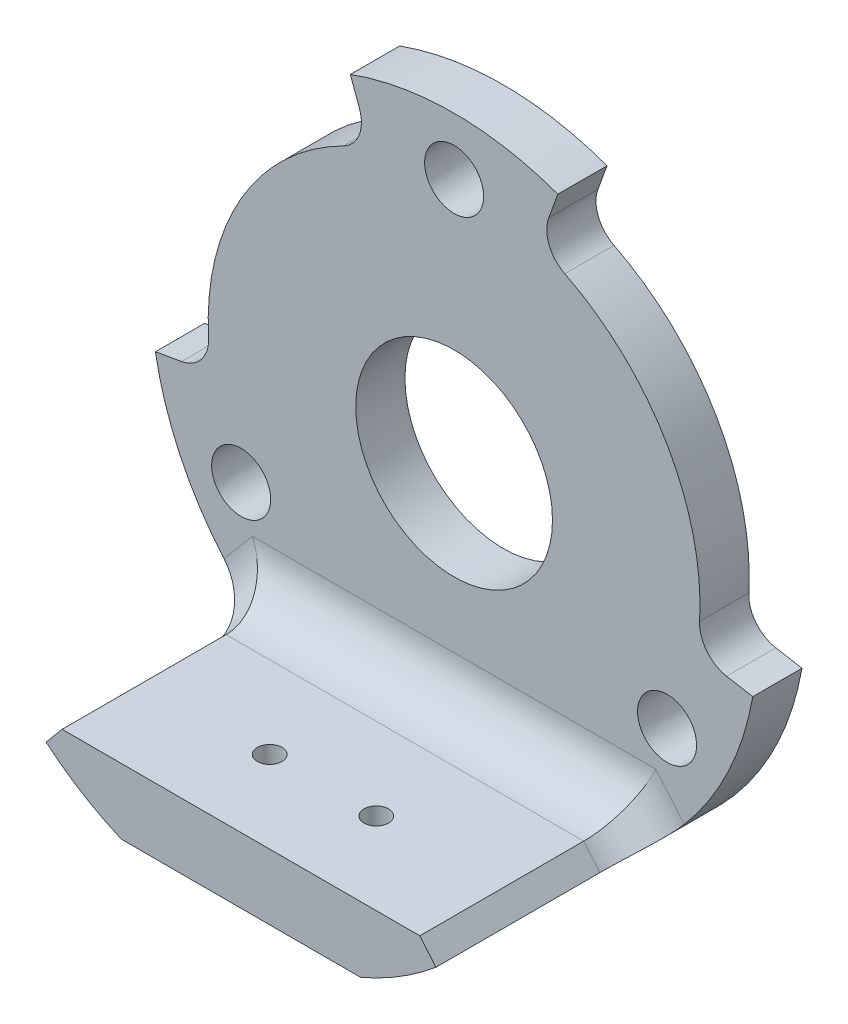
ISO-10303-21;
HEADER;
FILE_DESCRIPTION(('STEP AP214'),'2;1');
FILE_NAME('part.step','',(''),(''),'','','');
FILE_SCHEMA(('AUTOMOTIVE_DESIGN { 1 0 10303 214 1 1 1 1 }'));
ENDSEC;
DATA;
#1=APPLICATION_CONTEXT('core data for automotive mechanical design processes');
#2=APPLICATION_PROTOCOL_DEFINITION('international standard','automotive_design',2000,#1);
#3=PRODUCT_CONTEXT('',#1,'mechanical');
#4=PRODUCT('Part','Part','',(#3));
#5=PRODUCT_RELATED_PRODUCT_CATEGORY('part','',(#4));
#6=PRODUCT_DEFINITION_FORMATION('','',#4);
#7=PRODUCT_DEFINITION_CONTEXT('part definition',#1,'design');
#8=PRODUCT_DEFINITION('design','',#6,#7);
#9=PRODUCT_DEFINITION_SHAPE('','',#8);
#10=(LENGTH_UNIT() NAMED_UNIT(*) SI_UNIT(.MILLI.,.METRE.));
#11=(NAMED_UNIT(*) PLANE_ANGLE_UNIT() SI_UNIT($,.RADIAN.));
#12=(NAMED_UNIT(*) SI_UNIT($,.STERADIAN.) SOLID_ANGLE_UNIT());
#13=UNCERTAINTY_MEASURE_WITH_UNIT(LENGTH_MEASURE(1.E-05),#10,'distance_accuracy_value','');
#14=(GEOMETRIC_REPRESENTATION_CONTEXT(3) GLOBAL_UNCERTAINTY_ASSIGNED_CONTEXT((#13)) GLOBAL_UNIT_ASSIGNED_CONTEXT((#10,
#11,#12)) REPRESENTATION_CONTEXT('',''));
#15=CARTESIAN_POINT('',(0.,0.,0.));
#16=DIRECTION('',(0.,0.,1.));
#17=DIRECTION('',(1.,0.,0.));
#18=AXIS2_PLACEMENT_3D('',#15,#16,#17);
#19=CARTESIAN_POINT('',(-450.,300.,16.));
#20=DIRECTION('',(0.,0.,-1.));
#21=DIRECTION('',(-1.,0.,0.));
#22=AXIS2_PLACEMENT_3D('',#19,#20,#21);
#23=CYLINDRICAL_SURFACE('',#22,18.4999999999999);
#24=DIRECTION('',(0.,0.,-1.));
#25=VECTOR('',#24,1.);
#26=CARTESIAN_POINT('',(-468.218943430726,296.787508713162,16.));
#27=LINE('',#26,#25);
#28=CARTESIAN_POINT('',(-468.218943430726,296.787508713162,3.));
#29=VERTEX_POINT('',#28);
#30=CARTESIAN_POINT('',(-468.218943430726,296.787508713162,0.));
#31=VERTEX_POINT('',#30);
#32=EDGE_CURVE('E184',#29,#31,#27,.T.);
#33=ORIENTED_EDGE('',*,*,#32,.T.);
#34=CARTESIAN_POINT('',(-450.,300.,0.));
#35=DIRECTION('',(0.,0.,-1.));
#36=DIRECTION('',(-1.,0.,0.));
#37=AXIS2_PLACEMENT_3D('',#34,#35,#36);
#38=CIRCLE('',#37,18.4999999999999);
#39=CARTESIAN_POINT('',(-457.297259759663,283.,0.));
#40=VERTEX_POINT('',#39);
#41=EDGE_CURVE('E201',#40,#31,#38,.T.);
#42=ORIENTED_EDGE('',*,*,#41,.F.);
#43=DIRECTION('',(0.,0.,-1.));
#44=VECTOR('',#43,1.);
#45=CARTESIAN_POINT('',(-457.297259759663,283.,16.));
#46=LINE('',#45,#44);
#47=CARTESIAN_POINT('',(-457.297259759663,283.,16.));
#48=VERTEX_POINT('',#47);
#49=EDGE_CURVE('E214',#48,#40,#46,.T.);
#50=ORIENTED_EDGE('',*,*,#49,.F.);
#51=CARTESIAN_POINT('',(-450.,300.,16.));
#52=DIRECTION('',(0.,0.,-1.));
#53=DIRECTION('',(-1.,0.,0.));
#54=AXIS2_PLACEMENT_3D('',#51,#52,#53);
#55=CIRCLE('',#54,18.4999999999999);
#56=CARTESIAN_POINT('',(-461.891570779201,285.828177802299,16.));
#57=VERTEX_POINT('',#56);
#58=EDGE_CURVE('E363',#48,#57,#55,.T.);
#59=ORIENTED_EDGE('',*,*,#58,.T.);
#60=DIRECTION('',(0.,0.,1.));
#61=VECTOR('',#60,1.);
#62=CARTESIAN_POINT('',(-461.891570779201,285.828177802299,3.));
#63=LINE('',#62,#61);
#64=CARTESIAN_POINT('',(-461.891570779201,285.828177802299,6.));
#65=VERTEX_POINT('',#64);
#66=EDGE_CURVE('E372',#65,#57,#63,.T.);
#67=ORIENTED_EDGE('',*,*,#66,.F.);
#68=CARTESIAN_POINT('',(-461.891570779201,285.828177802299,6.));
#69=CARTESIAN_POINT('',(-461.891561832716,285.828175903261,5.91564209092245));
#70=CARTESIAN_POINT('',(-461.894296370243,285.830464991089,5.8312880154373));
#71=CARTESIAN_POINT('',(-461.905184455433,285.839608915823,5.66318300067403));
#72=CARTESIAN_POINT('',(-461.913337749161,285.846463538778,5.57943203331897));
#73=CARTESIAN_POINT('',(-461.934987712819,285.864715830558,5.4131797233746));
#74=CARTESIAN_POINT('',(-461.948480585121,285.8761102706,5.33067753582939));
#75=CARTESIAN_POINT('',(-461.980660538156,285.903397084787,5.16747396488535));
#76=CARTESIAN_POINT('',(-461.99934755538,285.919289403934,5.08677255948084));
#77=CARTESIAN_POINT('',(-462.062974690479,285.973674498502,4.84814574209821));
#78=CARTESIAN_POINT('',(-462.115489503887,286.018882523045,4.69363250397793));
#79=CARTESIAN_POINT('',(-462.238582123251,286.126509326838,4.39855187902926));
#80=CARTESIAN_POINT('',(-462.309156819291,286.188925143047,4.25798209691254));
#81=CARTESIAN_POINT('',(-462.465581310532,286.329947684353,3.99480370285346));
#82=CARTESIAN_POINT('',(-462.551414094702,286.408536393742,3.87217536298743));
#83=CARTESIAN_POINT('',(-462.735167099182,286.580561890107,3.64821456642375));
#84=CARTESIAN_POINT('',(-462.833088352432,286.673999946131,3.54688393158154));
#85=CARTESIAN_POINT('',(-463.036930499919,286.873360768654,3.36878772342432));
#86=CARTESIAN_POINT('',(-463.142814088538,286.979226475978,3.29191546093324));
#87=CARTESIAN_POINT('',(-463.359229889972,287.201368707071,3.16420670205903));
#88=CARTESIAN_POINT('',(-463.469760203595,287.31764099902,3.11335967856258));
#89=CARTESIAN_POINT('',(-463.656309640338,287.519310136634,3.050756367322));
#90=CARTESIAN_POINT('',(-463.732099900945,287.602735984173,3.03170618353173));
#91=CARTESIAN_POINT('',(-463.88296187137,287.77190385761,3.00632821535811));
#92=CARTESIAN_POINT('',(-463.958034501051,287.857642155565,2.9999810649817));
#93=CARTESIAN_POINT('',(-464.032308732693,287.944117136004,3.));
#94=B_SPLINE_CURVE_WITH_KNOTS('',3,(#68,#69,#70,#71,#72,#73,#74,#75,#76,#77,#78,#79,#80,#81,#82,
#83,#84,#85,#86,#87,#88,#89,#90,#91,#92,#93),.UNSPECIFIED.,.F.,.F.,(4,2,2,2,2,2,2,2,2,2,2,2,4),
(0.,0.252991459089391,0.505971063339032,0.758771065233071,1.01156797620218,1.51696577565738,
2.02227660401802,2.52702756173576,3.03182167947232,3.53438266130612,4.03674019810098,
4.37898172370028,4.72070109755064),.UNSPECIFIED.);
#95=CARTESIAN_POINT('',(-464.032308732691,287.944117136006,3.));
#96=VERTEX_POINT('',#95);
#97=EDGE_CURVE('E11',#65,#96,#94,.T.);
#98=ORIENTED_EDGE('',*,*,#97,.T.);
#99=CARTESIAN_POINT('',(-450.,300.,3.));
#100=DIRECTION('',(0.,0.,1.));
#101=DIRECTION('',(1.,0.,0.));
#102=AXIS2_PLACEMENT_3D('',#99,#100,#101);
#103=CIRCLE('',#102,18.4999999999974);
#104=EDGE_CURVE('E349',#29,#96,#103,.T.);
#105=ORIENTED_EDGE('',*,*,#104,.F.);
#106=EDGE_LOOP('',(#33,#42,#50,#59,#67,#98,#105));
#107=FACE_BOUND('',#106,.T.);
#108=ADVANCED_FACE('F33',(#107),#23,.T.);
#109=DIRECTION('',(0.,0.,-1.));
#110=VECTOR('',#109,1.);
#111=CARTESIAN_POINT('',(-456.327372651525,317.38431348454,16.));
#112=LINE('',#111,#110);
#113=CARTESIAN_POINT('',(-456.327372651525,317.38431348454,3.));
#114=VERTEX_POINT('',#113);
#115=CARTESIAN_POINT('',(-456.327372651525,317.38431348454,0.));
#116=VERTEX_POINT('',#115);
#117=EDGE_CURVE('E173',#114,#116,#112,.T.);
#118=ORIENTED_EDGE('',*,*,#117,.F.);
#119=CARTESIAN_POINT('',(-443.672627348475,317.384313484539,3.));
#120=VERTEX_POINT('',#119);
#121=EDGE_CURVE('E388',#120,#114,#103,.T.);
#122=ORIENTED_EDGE('',*,*,#121,.F.);
#123=DIRECTION('',(0.,0.,-1.));
#124=VECTOR('',#123,1.);
#125=CARTESIAN_POINT('',(-443.672627348475,317.384313484539,16.));
#126=LINE('',#125,#124);
#127=CARTESIAN_POINT('',(-443.672627348475,317.384313484539,0.));
#128=VERTEX_POINT('',#127);
#129=EDGE_CURVE('E200',#120,#128,#126,.T.);
#130=ORIENTED_EDGE('',*,*,#129,.T.);
#131=EDGE_CURVE('E192',#116,#128,#38,.T.);
#132=ORIENTED_EDGE('',*,*,#131,.F.);
#133=EDGE_LOOP('',(#118,#122,#130,#132));
#134=FACE_BOUND('',#133,.T.);
#135=ADVANCED_FACE('F199',(#134),#23,.T.);
#136=DIRECTION('',(0.,0.,-1.));
#137=VECTOR('',#136,1.);
#138=CARTESIAN_POINT('',(-431.781056569274,296.787508713161,16.));
#139=LINE('',#138,#137);
#140=CARTESIAN_POINT('',(-431.781056569274,296.787508713161,3.));
#141=VERTEX_POINT('',#140);
#142=CARTESIAN_POINT('',(-431.781056569274,296.787508713161,0.));
#143=VERTEX_POINT('',#142);
#144=EDGE_CURVE('E389',#141,#143,#139,.T.);
#145=ORIENTED_EDGE('',*,*,#144,.F.);
#146=CARTESIAN_POINT('',(-435.967691267309,287.944117136006,3.));
#147=VERTEX_POINT('',#146);
#148=EDGE_CURVE('E375',#147,#141,#103,.T.);
#149=ORIENTED_EDGE('',*,*,#148,.F.);
#150=CARTESIAN_POINT('',(-435.967691267309,287.944117136006,3.));
#151=CARTESIAN_POINT('',(-436.022605743689,287.880191690059,2.99999169666253));
#152=CARTESIAN_POINT('',(-436.077965087806,287.8166486427,3.00345764900537));
#153=CARTESIAN_POINT('',(-436.18916216855,287.690744934522,3.01732267149366));
#154=CARTESIAN_POINT('',(-436.244999922636,287.628384317121,3.02772199572152));
#155=CARTESIAN_POINT('',(-436.356706877025,287.505302532349,3.05543054888459));
#156=CARTESIAN_POINT('',(-436.412576041819,287.444580459957,3.07273587640424));
#157=CARTESIAN_POINT('',(-436.523909730982,287.325156012423,3.11415296284034));
#158=CARTESIAN_POINT('',(-436.579374271127,287.26645355821,3.13826445494451));
#159=CARTESIAN_POINT('',(-436.744584221255,287.093830362407,3.2206873432757));
#160=CARTESIAN_POINT('',(-436.853143520378,286.983396466812,3.28908654735076));
#161=CARTESIAN_POINT('',(-437.062986585019,286.774809934657,3.45086215034474));
#162=CARTESIAN_POINT('',(-437.164272601668,286.676653491105,3.54423077842327));
#163=CARTESIAN_POINT('',(-437.355320342544,286.49521096258,3.75264336084271));
#164=CARTESIAN_POINT('',(-437.445156115387,286.411827808455,3.86753477551894));
#165=CARTESIAN_POINT('',(-437.610779189328,286.260646937639,4.11619778790703));
#166=CARTESIAN_POINT('',(-437.686563018785,286.19285307141,4.24997403692099));
#167=CARTESIAN_POINT('',(-437.82139822441,286.073772849906,4.53303567438746));
#168=CARTESIAN_POINT('',(-437.880397399014,286.022537928427,4.68236751641708));
#169=CARTESIAN_POINT('',(-437.979049941357,285.9376026343,4.99196595185073));
#170=CARTESIAN_POINT('',(-438.018713392267,285.90389312191,5.15222679620042));
#171=CARTESIAN_POINT('',(-438.067997258799,285.862178146174,5.42775591691575));
#172=CARTESIAN_POINT('',(-438.083138440994,285.849427079123,5.54137332577848));
#173=CARTESIAN_POINT('',(-438.103359449919,285.832431780661,5.76997852402208));
#174=CARTESIAN_POINT('',(-438.108452397653,285.828176455406,5.8849643287814));
#175=CARTESIAN_POINT('',(-438.108429220799,285.828177802299,5.99999999999999));
#176=B_SPLINE_CURVE_WITH_KNOTS('',3,(#150,#151,#152,#153,#154,#155,#156,#157,#158,#159,#160,
#161,#162,#163,#164,#165,#166,#167,#168,#169,#170,#171,#172,#173,#174,#175),.UNSPECIFIED.,.F.,
.F.,(4,2,2,2,2,2,2,2,2,2,2,2,4),(0.,0.252746363601873,0.505501989931476,0.758115028444334,
1.01071816550672,1.51593532198415,2.02099543029234,2.52260286111636,3.02433405323906,
3.52760902232846,4.03062126266192,4.37589166843464,4.72071092022148),.UNSPECIFIED.);
#177=CARTESIAN_POINT('',(-438.108429220802,285.828177802303,6.));
#178=VERTEX_POINT('',#177);
#179=EDGE_CURVE('E43',#147,#178,#176,.T.);
#180=ORIENTED_EDGE('',*,*,#179,.T.);
#181=DIRECTION('',(0.,0.,1.));
#182=VECTOR('',#181,1.);
#183=CARTESIAN_POINT('',(-438.108429220802,285.828177802303,3.));
#184=LINE('',#183,#182);
#185=CARTESIAN_POINT('',(-438.108429220802,285.828177802303,16.));
#186=VERTEX_POINT('',#185);
#187=EDGE_CURVE('E206',#178,#186,#184,.T.);
#188=ORIENTED_EDGE('',*,*,#187,.T.);
#189=CARTESIAN_POINT('',(-442.702740240337,283.,16.));
#190=VERTEX_POINT('',#189);
#191=EDGE_CURVE('E213',#186,#190,#55,.T.);
#192=ORIENTED_EDGE('',*,*,#191,.T.);
#193=DIRECTION('',(0.,0.,-1.));
#194=VECTOR('',#193,1.);
#195=CARTESIAN_POINT('',(-442.702740240337,283.,16.));
#196=LINE('',#195,#194);
#197=CARTESIAN_POINT('',(-442.702740240337,283.,0.));
#198=VERTEX_POINT('',#197);
#199=EDGE_CURVE('E217',#190,#198,#196,.T.);
#200=ORIENTED_EDGE('',*,*,#199,.T.);
#201=EDGE_CURVE('E202',#143,#198,#38,.T.);
#202=ORIENTED_EDGE('',*,*,#201,.F.);
#203=EDGE_LOOP('',(#145,#149,#180,#188,#192,#200,#202));
#204=FACE_BOUND('',#203,.T.);
#205=ADVANCED_FACE('F310',(#204),#23,.T.);
#206=CARTESIAN_POINT('',(-442.702740240337,283.,16.));
#207=DIRECTION('',(0.,-1.,0.));
#208=DIRECTION('',(0.,0.,-1.));
#209=AXIS2_PLACEMENT_3D('',#206,#207,#208);
#210=PLANE('',#209);
#211=CARTESIAN_POINT('',(-446.75,283.,11.));
#212=DIRECTION('',(0.,-1.,0.));
#213=DIRECTION('',(0.,0.,-1.));
#214=AXIS2_PLACEMENT_3D('',#211,#212,#213);
#215=CIRCLE('',#214,0.749999999999973);
#216=CARTESIAN_POINT('',(-446.75,283.,10.25));
#217=VERTEX_POINT('',#216);
#218=EDGE_CURVE('E240',#217,#217,#215,.T.);
#219=ORIENTED_EDGE('',*,*,#218,.F.);
#220=EDGE_LOOP('',(#219));
#221=FACE_BOUND('',#220,.T.);
#222=CARTESIAN_POINT('',(-453.25,283.,11.));
#223=DIRECTION('',(0.,-1.,0.));
#224=DIRECTION('',(0.,0.,-1.));
#225=AXIS2_PLACEMENT_3D('',#222,#223,#224);
#226=CIRCLE('',#225,0.749999999999973);
#227=CARTESIAN_POINT('',(-453.25,283.,10.25));
#228=VERTEX_POINT('',#227);
#229=EDGE_CURVE('E239',#228,#228,#226,.T.);
#230=ORIENTED_EDGE('',*,*,#229,.F.);
#231=EDGE_LOOP('',(#230));
#232=FACE_BOUND('',#231,.T.);
#233=DIRECTION('',(-1.,0.,0.));
#234=VECTOR('',#233,1.);
#235=CARTESIAN_POINT('',(-442.702740240337,283.,0.));
#236=LINE('',#235,#234);
#237=EDGE_CURVE('E205',#198,#40,#236,.T.);
#238=ORIENTED_EDGE('',*,*,#237,.F.);
#239=ORIENTED_EDGE('',*,*,#199,.F.);
#240=DIRECTION('',(-1.,0.,0.));
#241=VECTOR('',#240,1.);
#242=CARTESIAN_POINT('',(-442.702740240337,283.,16.));
#243=LINE('',#242,#241);
#244=EDGE_CURVE('E209',#190,#48,#243,.T.);
#245=ORIENTED_EDGE('',*,*,#244,.T.);
#246=ORIENTED_EDGE('',*,*,#49,.T.);
#247=EDGE_LOOP('',(#238,#239,#245,#246));
#248=FACE_BOUND('',#247,.T.);
#249=ADVANCED_FACE('F315',(#221,#232,#248),#210,.T.);
#250=CARTESIAN_POINT('',(-450.,300.,16.));
#251=DIRECTION('',(0.,0.,-1.));
#252=DIRECTION('',(-1.,0.,0.));
#253=AXIS2_PLACEMENT_3D('',#250,#251,#252);
#254=PLANE('',#253);
#255=ORIENTED_EDGE('',*,*,#191,.F.);
#256=DIRECTION('',(0.642787609686601,-0.766044443118926,0.));
#257=VECTOR('',#256,1.);
#258=CARTESIAN_POINT('',(-439.091704794695,287.,16.));
#259=LINE('',#258,#257);
#260=CARTESIAN_POINT('',(-439.091704794695,287.,16.));
#261=VERTEX_POINT('',#260);
#262=EDGE_CURVE('E380',#261,#186,#259,.T.);
#263=ORIENTED_EDGE('',*,*,#262,.F.);
#264=DIRECTION('',(1.,0.,0.));
#265=VECTOR('',#264,1.);
#266=CARTESIAN_POINT('',(-460.908295205305,287.,16.));
#267=LINE('',#266,#265);
#268=CARTESIAN_POINT('',(-460.908295205305,287.,16.));
#269=VERTEX_POINT('',#268);
#270=EDGE_CURVE('E383',#269,#261,#267,.T.);
#271=ORIENTED_EDGE('',*,*,#270,.F.);
#272=DIRECTION('',(0.64278760968643,0.76604444311907,0.));
#273=VECTOR('',#272,1.);
#274=CARTESIAN_POINT('',(-461.891570779201,285.828177802299,16.));
#275=LINE('',#274,#273);
#276=EDGE_CURVE('E370',#57,#269,#275,.T.);
#277=ORIENTED_EDGE('',*,*,#276,.F.);
#278=ORIENTED_EDGE('',*,*,#58,.F.);
#279=ORIENTED_EDGE('',*,*,#244,.F.);
#280=EDGE_LOOP('',(#255,#263,#271,#277,#278,#279));
#281=FACE_BOUND('',#280,.T.);
#282=ADVANCED_FACE('F367',(#281),#254,.F.);
#283=CARTESIAN_POINT('',(-450.,300.,0.));
#284=DIRECTION('',(0.,0.,-1.));
#285=DIRECTION('',(-1.,0.,0.));
#286=AXIS2_PLACEMENT_3D('',#283,#284,#285);
#287=PLANE('',#286);
#288=CARTESIAN_POINT('',(-437.009618943233,292.5,0.));
#289=DIRECTION('',(0.,0.,-1.));
#290=DIRECTION('',(-1.,0.,0.));
#291=AXIS2_PLACEMENT_3D('',#288,#289,#290);
#292=CIRCLE('',#291,1.79999999999997);
#293=CARTESIAN_POINT('',(-438.809618943233,292.5,0.));
#294=VERTEX_POINT('',#293);
#295=EDGE_CURVE('E253',#294,#294,#292,.T.);
#296=ORIENTED_EDGE('',*,*,#295,.F.);
#297=EDGE_LOOP('',(#296));
#298=FACE_BOUND('',#297,.T.);
#299=CARTESIAN_POINT('',(-450.,315.,0.));
#300=DIRECTION('',(0.,0.,-1.));
#301=DIRECTION('',(-1.,0.,0.));
#302=AXIS2_PLACEMENT_3D('',#299,#300,#301);
#303=CIRCLE('',#302,1.79999999999997);
#304=CARTESIAN_POINT('',(-451.8,315.,0.));
#305=VERTEX_POINT('',#304);
#306=EDGE_CURVE('E249',#305,#305,#303,.T.);
#307=ORIENTED_EDGE('',*,*,#306,.F.);
#308=EDGE_LOOP('',(#307));
#309=FACE_BOUND('',#308,.T.);
#310=CARTESIAN_POINT('',(-462.990381056767,292.5,0.));
#311=DIRECTION('',(0.,0.,-1.));
#312=DIRECTION('',(-1.,0.,0.));
#313=AXIS2_PLACEMENT_3D('',#310,#311,#312);
#314=CIRCLE('',#313,1.79999999999997);
#315=CARTESIAN_POINT('',(-464.790381056767,292.5,0.));
#316=VERTEX_POINT('',#315);
#317=EDGE_CURVE('E248',#316,#316,#314,.T.);
#318=ORIENTED_EDGE('',*,*,#317,.F.);
#319=EDGE_LOOP('',(#318));
#320=FACE_BOUND('',#319,.T.);
#321=CARTESIAN_POINT('',(-450.,300.,0.));
#322=DIRECTION('',(0.,0.,-1.));
#323=DIRECTION('',(-1.,0.,0.));
#324=AXIS2_PLACEMENT_3D('',#321,#322,#323);
#325=CIRCLE('',#324,6.00000000000001);
#326=CARTESIAN_POINT('',(-456.,300.,0.));
#327=VERTEX_POINT('',#326);
#328=EDGE_CURVE('E244',#327,#327,#325,.T.);
#329=ORIENTED_EDGE('',*,*,#328,.F.);
#330=EDGE_LOOP('',(#329));
#331=FACE_BOUND('',#330,.T.);
#332=DIRECTION('',(-0.984807753012212,-0.173648177666908,0.));
#333=VECTOR('',#332,1.);
#334=CARTESIAN_POINT('',(-464.772116295183,297.395277334996,0.));
#335=LINE('',#334,#333);
#336=CARTESIAN_POINT('',(-466.625468368199,297.068481359772,0.));
#337=VERTEX_POINT('',#336);
#338=EDGE_CURVE('E185',#337,#31,#335,.T.);
#339=ORIENTED_EDGE('',*,*,#338,.F.);
#340=CARTESIAN_POINT('',(-466.972764723533,299.038096865796,0.));
#341=DIRECTION('',(0.,0.,-1.));
#342=DIRECTION('',(-1.,0.,0.));
#343=AXIS2_PLACEMENT_3D('',#340,#341,#342);
#344=CIRCLE('',#343,2.);
#345=CARTESIAN_POINT('',(-464.975968873706,299.151261940408,0.));
#346=VERTEX_POINT('',#345);
#347=EDGE_CURVE('E277',#337,#346,#344,.F.);
#348=ORIENTED_EDGE('',*,*,#347,.T.);
#349=CARTESIAN_POINT('',(-450.,300.,0.));
#350=DIRECTION('',(0.,0.,1.));
#351=DIRECTION('',(1.,0.,0.));
#352=AXIS2_PLACEMENT_3D('',#349,#350,#351);
#353=CIRCLE('',#352,15.);
#354=CARTESIAN_POINT('',(-456.752955716087,313.39393852071,0.));
#355=VERTEX_POINT('',#354);
#356=EDGE_CURVE('E196',#355,#346,#353,.T.);
#357=ORIENTED_EDGE('',*,*,#356,.F.);
#358=CARTESIAN_POINT('',(-457.653349811566,315.179796990138,0.));
#359=DIRECTION('',(0.,0.,-1.));
#360=DIRECTION('',(-1.,0.,0.));
#361=AXIS2_PLACEMENT_3D('',#358,#359,#360);
#362=CIRCLE('',#361,2.);
#363=CARTESIAN_POINT('',(-455.773964569994,315.86383727679,0.));
#364=VERTEX_POINT('',#363);
#365=EDGE_CURVE('E195',#355,#364,#362,.F.);
#366=ORIENTED_EDGE('',*,*,#365,.T.);
#367=DIRECTION('',(0.342020143325796,-0.939692620785862,0.));
#368=VECTOR('',#367,1.);
#369=CARTESIAN_POINT('',(-456.327372651525,317.38431348454,0.));
#370=LINE('',#369,#368);
#371=EDGE_CURVE('E176',#116,#364,#370,.T.);
#372=ORIENTED_EDGE('',*,*,#371,.F.);
#373=ORIENTED_EDGE('',*,*,#131,.T.);
#374=DIRECTION('',(0.342020143325695,0.939692620785899,0.));
#375=VECTOR('',#374,1.);
#376=CARTESIAN_POINT('',(-444.869697850115,314.095389311789,0.));
#377=LINE('',#376,#375);
#378=CARTESIAN_POINT('',(-444.226035430006,315.863837276789,0.));
#379=VERTEX_POINT('',#378);
#380=EDGE_CURVE('E391',#379,#128,#377,.T.);
#381=ORIENTED_EDGE('',*,*,#380,.F.);
#382=CARTESIAN_POINT('',(-442.346650188434,315.179796990138,0.));
#383=DIRECTION('',(0.,0.,-1.));
#384=DIRECTION('',(-1.,0.,0.));
#385=AXIS2_PLACEMENT_3D('',#382,#383,#384);
#386=CIRCLE('',#385,2.);
#387=CARTESIAN_POINT('',(-443.247044283912,313.39393852071,0.));
#388=VERTEX_POINT('',#387);
#389=EDGE_CURVE('E284',#379,#388,#386,.F.);
#390=ORIENTED_EDGE('',*,*,#389,.T.);
#391=CARTESIAN_POINT('',(-450.,300.,0.));
#392=DIRECTION('',(0.,0.,1.));
#393=DIRECTION('',(1.,0.,0.));
#394=AXIS2_PLACEMENT_3D('',#391,#392,#393);
#395=CIRCLE('',#394,15.);
#396=CARTESIAN_POINT('',(-435.024031126294,299.151261940408,0.));
#397=VERTEX_POINT('',#396);
#398=EDGE_CURVE('E394',#397,#388,#395,.T.);
#399=ORIENTED_EDGE('',*,*,#398,.F.);
#400=CARTESIAN_POINT('',(-433.027235276467,299.038096865796,0.));
#401=DIRECTION('',(0.,0.,-1.));
#402=DIRECTION('',(-1.,0.,0.));
#403=AXIS2_PLACEMENT_3D('',#400,#401,#402);
#404=CIRCLE('',#403,2.);
#405=CARTESIAN_POINT('',(-433.374531631801,297.068481359771,0.));
#406=VERTEX_POINT('',#405);
#407=EDGE_CURVE('E273',#397,#406,#404,.F.);
#408=ORIENTED_EDGE('',*,*,#407,.T.);
#409=DIRECTION('',(-0.984807753012188,0.173648177667046,0.));
#410=VECTOR('',#409,1.);
#411=CARTESIAN_POINT('',(-431.781056569274,296.787508713161,0.));
#412=LINE('',#411,#410);
#413=EDGE_CURVE('E352',#143,#406,#412,.T.);
#414=ORIENTED_EDGE('',*,*,#413,.F.);
#415=ORIENTED_EDGE('',*,*,#201,.T.);
#416=ORIENTED_EDGE('',*,*,#237,.T.);
#417=ORIENTED_EDGE('',*,*,#41,.T.);
#418=EDGE_LOOP('',(#339,#348,#357,#366,#372,#373,#381,#390,#399,#408,#414,#415,#416,#417));
#419=FACE_BOUND('',#418,.T.);
#420=ADVANCED_FACE('F190',(#298,#309,#320,#331,#419),#287,.T.);
#421=CARTESIAN_POINT('',(-439.091704794695,287.,3.));
#422=DIRECTION('',(-0.766044443118926,-0.642787609686601,0.));
#423=DIRECTION('',(0.642787609686601,-0.766044443118926,0.));
#424=AXIS2_PLACEMENT_3D('',#421,#422,#423);
#425=PLANE('',#424);
#426=ORIENTED_EDGE('',*,*,#187,.F.);
#427=DIRECTION('',(0.642787609686601,-0.766044443118926,0.));
#428=VECTOR('',#427,1.);
#429=CARTESIAN_POINT('',(-439.091704794695,287.,6.));
#430=LINE('',#429,#428);
#431=CARTESIAN_POINT('',(-439.091704794695,287.,6.));
#432=VERTEX_POINT('',#431);
#433=EDGE_CURVE('E295',#178,#432,#430,.F.);
#434=ORIENTED_EDGE('',*,*,#433,.T.);
#435=DIRECTION('',(0.,0.,1.));
#436=VECTOR('',#435,1.);
#437=CARTESIAN_POINT('',(-439.091704794695,287.,3.));
#438=LINE('',#437,#436);
#439=EDGE_CURVE('E377',#432,#261,#438,.T.);
#440=ORIENTED_EDGE('',*,*,#439,.T.);
#441=ORIENTED_EDGE('',*,*,#262,.T.);
#442=EDGE_LOOP('',(#426,#434,#440,#441));
#443=FACE_BOUND('',#442,.T.);
#444=ADVANCED_FACE('F440',(#443),#425,.F.);
#445=CARTESIAN_POINT('',(-460.908295205305,287.,3.));
#446=DIRECTION('',(0.,-1.,0.));
#447=DIRECTION('',(0.,0.,-1.));
#448=AXIS2_PLACEMENT_3D('',#445,#446,#447);
#449=PLANE('',#448);
#450=CARTESIAN_POINT('',(-446.75,287.,11.));
#451=DIRECTION('',(0.,-1.,0.));
#452=DIRECTION('',(0.,0.,-1.));
#453=AXIS2_PLACEMENT_3D('',#450,#451,#452);
#454=CIRCLE('',#453,0.749999999999973);
#455=CARTESIAN_POINT('',(-446.75,287.,10.25));
#456=VERTEX_POINT('',#455);
#457=EDGE_CURVE('E236',#456,#456,#454,.T.);
#458=ORIENTED_EDGE('',*,*,#457,.T.);
#459=EDGE_LOOP('',(#458));
#460=FACE_BOUND('',#459,.T.);
#461=CARTESIAN_POINT('',(-453.25,287.,11.));
#462=DIRECTION('',(0.,-1.,0.));
#463=DIRECTION('',(0.,0.,-1.));
#464=AXIS2_PLACEMENT_3D('',#461,#462,#463);
#465=CIRCLE('',#464,0.749999999999973);
#466=CARTESIAN_POINT('',(-453.25,287.,10.25));
#467=VERTEX_POINT('',#466);
#468=EDGE_CURVE('E197',#467,#467,#465,.T.);
#469=ORIENTED_EDGE('',*,*,#468,.T.);
#470=EDGE_LOOP('',(#469));
#471=FACE_BOUND('',#470,.T.);
#472=ORIENTED_EDGE('',*,*,#439,.F.);
#473=DIRECTION('',(1.,0.,0.));
#474=VECTOR('',#473,1.);
#475=CARTESIAN_POINT('',(-460.908295205305,287.,6.));
#476=LINE('',#475,#474);
#477=CARTESIAN_POINT('',(-460.908295205305,287.,6.));
#478=VERTEX_POINT('',#477);
#479=EDGE_CURVE('E59',#432,#478,#476,.F.);
#480=ORIENTED_EDGE('',*,*,#479,.T.);
#481=DIRECTION('',(0.,0.,1.));
#482=VECTOR('',#481,1.);
#483=CARTESIAN_POINT('',(-460.908295205305,287.,3.));
#484=LINE('',#483,#482);
#485=EDGE_CURVE('E374',#478,#269,#484,.T.);
#486=ORIENTED_EDGE('',*,*,#485,.T.);
#487=ORIENTED_EDGE('',*,*,#270,.T.);
#488=EDGE_LOOP('',(#472,#480,#486,#487));
#489=FACE_BOUND('',#488,.T.);
#490=ADVANCED_FACE('F437',(#460,#471,#489),#449,.F.);
#491=CARTESIAN_POINT('',(-461.891570779201,285.828177802299,3.));
#492=DIRECTION('',(0.76604444311907,-0.64278760968643,0.));
#493=DIRECTION('',(0.64278760968643,0.76604444311907,0.));
#494=AXIS2_PLACEMENT_3D('',#491,#492,#493);
#495=PLANE('',#494);
#496=ORIENTED_EDGE('',*,*,#485,.F.);
#497=DIRECTION('',(0.64278760968643,0.76604444311907,0.));
#498=VECTOR('',#497,1.);
#499=CARTESIAN_POINT('',(-461.891570779201,285.828177802299,6.));
#500=LINE('',#499,#498);
#501=EDGE_CURVE('E51',#478,#65,#500,.F.);
#502=ORIENTED_EDGE('',*,*,#501,.T.);
#503=ORIENTED_EDGE('',*,*,#66,.T.);
#504=ORIENTED_EDGE('',*,*,#276,.T.);
#505=EDGE_LOOP('',(#496,#502,#503,#504));
#506=FACE_BOUND('',#505,.T.);
#507=ADVANCED_FACE('F435',(#506),#495,.F.);
#508=CARTESIAN_POINT('',(-450.,300.,3.));
#509=DIRECTION('',(0.,0.,1.));
#510=DIRECTION('',(1.,0.,0.));
#511=AXIS2_PLACEMENT_3D('',#508,#509,#510);
#512=PLANE('',#511);
#513=CARTESIAN_POINT('',(-437.009618943233,292.5,3.));
#514=DIRECTION('',(0.,0.,1.));
#515=DIRECTION('',(1.,0.,0.));
#516=AXIS2_PLACEMENT_3D('',#513,#514,#515);
#517=CIRCLE('',#516,1.79999999999997);
#518=CARTESIAN_POINT('',(-435.209618943234,292.5,3.));
#519=VERTEX_POINT('',#518);
#520=EDGE_CURVE('E250',#519,#519,#517,.T.);
#521=ORIENTED_EDGE('',*,*,#520,.F.);
#522=EDGE_LOOP('',(#521));
#523=FACE_BOUND('',#522,.T.);
#524=CARTESIAN_POINT('',(-450.,315.,3.));
#525=DIRECTION('',(0.,0.,1.));
#526=DIRECTION('',(1.,0.,0.));
#527=AXIS2_PLACEMENT_3D('',#524,#525,#526);
#528=CIRCLE('',#527,1.79999999999997);
#529=CARTESIAN_POINT('',(-448.2,315.,3.));
#530=VERTEX_POINT('',#529);
#531=EDGE_CURVE('E245',#530,#530,#528,.T.);
#532=ORIENTED_EDGE('',*,*,#531,.F.);
#533=EDGE_LOOP('',(#532));
#534=FACE_BOUND('',#533,.T.);
#535=CARTESIAN_POINT('',(-462.990381056767,292.5,3.));
#536=DIRECTION('',(0.,0.,1.));
#537=DIRECTION('',(1.,0.,0.));
#538=AXIS2_PLACEMENT_3D('',#535,#536,#537);
#539=CIRCLE('',#538,1.79999999999997);
#540=CARTESIAN_POINT('',(-461.190381056767,292.5,3.));
#541=VERTEX_POINT('',#540);
#542=EDGE_CURVE('E410',#541,#541,#539,.T.);
#543=ORIENTED_EDGE('',*,*,#542,.F.);
#544=EDGE_LOOP('',(#543));
#545=FACE_BOUND('',#544,.T.);
#546=CARTESIAN_POINT('',(-450.,300.,3.));
#547=DIRECTION('',(0.,0.,1.));
#548=DIRECTION('',(1.,0.,0.));
#549=AXIS2_PLACEMENT_3D('',#546,#547,#548);
#550=CIRCLE('',#549,6.00000000000001);
#551=CARTESIAN_POINT('',(-444.,300.,3.));
#552=VERTEX_POINT('',#551);
#553=EDGE_CURVE('E241',#552,#552,#550,.T.);
#554=ORIENTED_EDGE('',*,*,#553,.F.);
#555=EDGE_LOOP('',(#554));
#556=FACE_BOUND('',#555,.T.);
#557=DIRECTION('',(1.,0.,0.));
#558=VECTOR('',#557,1.);
#559=CARTESIAN_POINT('',(-450.,290.,3.));
#560=LINE('',#559,#558);
#561=CARTESIAN_POINT('',(-462.30721817977,290.,3.));
#562=VERTEX_POINT('',#561);
#563=CARTESIAN_POINT('',(-437.692781820231,290.,3.));
#564=VERTEX_POINT('',#563);
#565=EDGE_CURVE('E288',#562,#564,#560,.T.);
#566=ORIENTED_EDGE('',*,*,#565,.T.);
#567=DIRECTION('',(0.642787609686601,-0.766044443118926,0.));
#568=VECTOR('',#567,1.);
#569=CARTESIAN_POINT('',(-447.701866670644,301.928362829059,3.));
#570=LINE('',#569,#568);
#571=EDGE_CURVE('E292',#564,#147,#570,.T.);
#572=ORIENTED_EDGE('',*,*,#571,.T.);
#573=ORIENTED_EDGE('',*,*,#148,.T.);
#574=DIRECTION('',(0.984807753012188,-0.173648177667046,0.));
#575=VECTOR('',#574,1.);
#576=CARTESIAN_POINT('',(-450.,300.000000000002,3.));
#577=LINE('',#576,#575);
#578=CARTESIAN_POINT('',(-433.374531631801,297.068481359771,3.));
#579=VERTEX_POINT('',#578);
#580=EDGE_CURVE('E216',#579,#141,#577,.T.);
#581=ORIENTED_EDGE('',*,*,#580,.F.);
#582=CARTESIAN_POINT('',(-433.027235276467,299.038096865796,3.));
#583=DIRECTION('',(0.,0.,1.));
#584=DIRECTION('',(1.,0.,0.));
#585=AXIS2_PLACEMENT_3D('',#582,#583,#584);
#586=CIRCLE('',#585,2.);
#587=CARTESIAN_POINT('',(-435.024031126294,299.151261940408,3.));
#588=VERTEX_POINT('',#587);
#589=EDGE_CURVE('E275',#579,#588,#586,.F.);
#590=ORIENTED_EDGE('',*,*,#589,.T.);
#591=CARTESIAN_POINT('',(-450.,300.,3.));
#592=DIRECTION('',(0.,0.,1.));
#593=DIRECTION('',(1.,0.,0.));
#594=AXIS2_PLACEMENT_3D('',#591,#592,#593);
#595=CIRCLE('',#594,15.);
#596=CARTESIAN_POINT('',(-443.247044283912,313.39393852071,3.));
#597=VERTEX_POINT('',#596);
#598=EDGE_CURVE('E222',#597,#588,#595,.F.);
#599=ORIENTED_EDGE('',*,*,#598,.F.);
#600=CARTESIAN_POINT('',(-442.346650188434,315.179796990138,3.));
#601=DIRECTION('',(0.,0.,1.));
#602=DIRECTION('',(1.,0.,0.));
#603=AXIS2_PLACEMENT_3D('',#600,#601,#602);
#604=CIRCLE('',#603,2.);
#605=CARTESIAN_POINT('',(-444.226035430006,315.863837276789,3.));
#606=VERTEX_POINT('',#605);
#607=EDGE_CURVE('E286',#597,#606,#604,.F.);
#608=ORIENTED_EDGE('',*,*,#607,.T.);
#609=DIRECTION('',(-0.342020143325695,-0.939692620785899,0.));
#610=VECTOR('',#609,1.);
#611=CARTESIAN_POINT('',(-450.,300.,3.));
#612=LINE('',#611,#610);
#613=EDGE_CURVE('E225',#120,#606,#612,.T.);
#614=ORIENTED_EDGE('',*,*,#613,.F.);
#615=ORIENTED_EDGE('',*,*,#121,.T.);
#616=DIRECTION('',(-0.342020143325796,0.939692620785862,0.));
#617=VECTOR('',#616,1.);
#618=CARTESIAN_POINT('',(-449.999999999998,300.000000000001,3.));
#619=LINE('',#618,#617);
#620=CARTESIAN_POINT('',(-455.773964569994,315.86383727679,3.));
#621=VERTEX_POINT('',#620);
#622=EDGE_CURVE('E179',#621,#114,#619,.T.);
#623=ORIENTED_EDGE('',*,*,#622,.F.);
#624=CARTESIAN_POINT('',(-457.653349811566,315.179796990138,3.));
#625=DIRECTION('',(0.,0.,1.));
#626=DIRECTION('',(1.,0.,0.));
#627=AXIS2_PLACEMENT_3D('',#624,#625,#626);
#628=CIRCLE('',#627,2.);
#629=CARTESIAN_POINT('',(-456.752955716087,313.39393852071,3.));
#630=VERTEX_POINT('',#629);
#631=EDGE_CURVE('E282',#621,#630,#628,.F.);
#632=ORIENTED_EDGE('',*,*,#631,.T.);
#633=CARTESIAN_POINT('',(-450.,300.,3.));
#634=DIRECTION('',(0.,0.,1.));
#635=DIRECTION('',(1.,0.,0.));
#636=AXIS2_PLACEMENT_3D('',#633,#634,#635);
#637=CIRCLE('',#636,15.);
#638=CARTESIAN_POINT('',(-464.975968873706,299.151261940408,3.));
#639=VERTEX_POINT('',#638);
#640=EDGE_CURVE('E229',#639,#630,#637,.F.);
#641=ORIENTED_EDGE('',*,*,#640,.F.);
#642=CARTESIAN_POINT('',(-466.972764723533,299.038096865796,3.));
#643=DIRECTION('',(0.,0.,1.));
#644=DIRECTION('',(1.,0.,0.));
#645=AXIS2_PLACEMENT_3D('',#642,#643,#644);
#646=CIRCLE('',#645,2.);
#647=CARTESIAN_POINT('',(-466.625468368199,297.068481359772,3.));
#648=VERTEX_POINT('',#647);
#649=EDGE_CURVE('E279',#639,#648,#646,.F.);
#650=ORIENTED_EDGE('',*,*,#649,.T.);
#651=DIRECTION('',(0.984807753012212,0.173648177666908,0.));
#652=VECTOR('',#651,1.);
#653=CARTESIAN_POINT('',(-450.,300.,3.));
#654=LINE('',#653,#652);
#655=EDGE_CURVE('E232',#29,#648,#654,.T.);
#656=ORIENTED_EDGE('',*,*,#655,.F.);
#657=ORIENTED_EDGE('',*,*,#104,.T.);
#658=DIRECTION('',(0.64278760968643,0.76604444311907,0.));
#659=VECTOR('',#658,1.);
#660=CARTESIAN_POINT('',(-452.298133329359,301.928362829061,3.));
#661=LINE('',#660,#659);
#662=EDGE_CURVE('E290',#96,#562,#661,.T.);
#663=ORIENTED_EDGE('',*,*,#662,.T.);
#664=EDGE_LOOP('',(#566,#572,#573,#581,#590,#599,#608,#614,#615,#623,#632,#641,#650,#656,#657,#663));
#665=FACE_BOUND('',#664,.T.);
#666=ADVANCED_FACE('F431',(#523,#534,#545,#556,#665),#512,.T.);
#667=CARTESIAN_POINT('',(-444.869697850115,314.095389311789,16.));
#668=DIRECTION('',(-0.939692620785899,0.342020143325695,0.));
#669=DIRECTION('',(-0.342020143325695,-0.939692620785899,0.));
#670=AXIS2_PLACEMENT_3D('',#667,#668,#669);
#671=PLANE('',#670);
#672=ORIENTED_EDGE('',*,*,#613,.T.);
#673=DIRECTION('',(0.,0.,1.));
#674=VECTOR('',#673,1.);
#675=CARTESIAN_POINT('',(-444.226035430006,315.863837276789,0.));
#676=LINE('',#675,#674);
#677=EDGE_CURVE('E270',#606,#379,#676,.F.);
#678=ORIENTED_EDGE('',*,*,#677,.T.);
#679=ORIENTED_EDGE('',*,*,#380,.T.);
#680=ORIENTED_EDGE('',*,*,#129,.F.);
#681=EDGE_LOOP('',(#672,#678,#679,#680));
#682=FACE_BOUND('',#681,.T.);
#683=ADVANCED_FACE('F456',(#682),#671,.F.);
#684=CARTESIAN_POINT('',(-450.,300.,16.));
#685=DIRECTION('',(0.,0.,-1.));
#686=DIRECTION('',(-1.,0.,0.));
#687=AXIS2_PLACEMENT_3D('',#684,#685,#686);
#688=CYLINDRICAL_SURFACE('',#687,15.);
#689=ORIENTED_EDGE('',*,*,#598,.T.);
#690=DIRECTION('',(0.,0.,-1.));
#691=VECTOR('',#690,1.);
#692=CARTESIAN_POINT('',(-435.024031126294,299.151261940408,16.));
#693=LINE('',#692,#691);
#694=EDGE_CURVE('E255',#588,#397,#693,.T.);
#695=ORIENTED_EDGE('',*,*,#694,.T.);
#696=ORIENTED_EDGE('',*,*,#398,.T.);
#697=DIRECTION('',(0.,0.,-1.));
#698=VECTOR('',#697,1.);
#699=CARTESIAN_POINT('',(-443.247044283912,313.39393852071,16.));
#700=LINE('',#699,#698);
#701=EDGE_CURVE('E235',#388,#597,#700,.F.);
#702=ORIENTED_EDGE('',*,*,#701,.T.);
#703=EDGE_LOOP('',(#689,#695,#696,#702));
#704=FACE_BOUND('',#703,.T.);
#705=ADVANCED_FACE('F450',(#704),#688,.T.);
#706=CARTESIAN_POINT('',(-431.781056569274,296.787508713161,16.));
#707=DIRECTION('',(-0.173648177667046,-0.984807753012188,0.));
#708=DIRECTION('',(0.984807753012188,-0.173648177667046,0.));
#709=AXIS2_PLACEMENT_3D('',#706,#707,#708);
#710=PLANE('',#709);
#711=ORIENTED_EDGE('',*,*,#413,.T.);
#712=DIRECTION('',(0.,0.,1.));
#713=VECTOR('',#712,1.);
#714=CARTESIAN_POINT('',(-433.374531631801,297.068481359771,3.));
#715=LINE('',#714,#713);
#716=EDGE_CURVE('E258',#406,#579,#715,.T.);
#717=ORIENTED_EDGE('',*,*,#716,.T.);
#718=ORIENTED_EDGE('',*,*,#580,.T.);
#719=ORIENTED_EDGE('',*,*,#144,.T.);
#720=EDGE_LOOP('',(#711,#717,#718,#719));
#721=FACE_BOUND('',#720,.T.);
#722=ADVANCED_FACE('F445',(#721),#710,.F.);
#723=CARTESIAN_POINT('',(-464.772116295183,297.395277334996,16.));
#724=DIRECTION('',(0.173648177666908,-0.984807753012212,0.));
#725=DIRECTION('',(0.984807753012212,0.173648177666908,0.));
#726=AXIS2_PLACEMENT_3D('',#723,#724,#725);
#727=PLANE('',#726);
#728=ORIENTED_EDGE('',*,*,#655,.T.);
#729=DIRECTION('',(0.,0.,1.));
#730=VECTOR('',#729,1.);
#731=CARTESIAN_POINT('',(-466.625468368199,297.068481359772,0.));
#732=LINE('',#731,#730);
#733=EDGE_CURVE('E260',#648,#337,#732,.F.);
#734=ORIENTED_EDGE('',*,*,#733,.T.);
#735=ORIENTED_EDGE('',*,*,#338,.T.);
#736=ORIENTED_EDGE('',*,*,#32,.F.);
#737=EDGE_LOOP('',(#728,#734,#735,#736));
#738=FACE_BOUND('',#737,.T.);
#739=ADVANCED_FACE('F470',(#738),#727,.F.);
#740=CARTESIAN_POINT('',(-450.,300.,16.));
#741=DIRECTION('',(0.,0.,-1.));
#742=DIRECTION('',(-1.,0.,0.));
#743=AXIS2_PLACEMENT_3D('',#740,#741,#742);
#744=CYLINDRICAL_SURFACE('',#743,15.);
#745=ORIENTED_EDGE('',*,*,#356,.T.);
#746=DIRECTION('',(0.,0.,-1.));
#747=VECTOR('',#746,1.);
#748=CARTESIAN_POINT('',(-464.975968873706,299.151261940408,16.));
#749=LINE('',#748,#747);
#750=EDGE_CURVE('E266',#346,#639,#749,.F.);
#751=ORIENTED_EDGE('',*,*,#750,.T.);
#752=ORIENTED_EDGE('',*,*,#640,.T.);
#753=DIRECTION('',(0.,0.,-1.));
#754=VECTOR('',#753,1.);
#755=CARTESIAN_POINT('',(-456.752955716087,313.39393852071,16.));
#756=LINE('',#755,#754);
#757=EDGE_CURVE('E263',#630,#355,#756,.T.);
#758=ORIENTED_EDGE('',*,*,#757,.T.);
#759=EDGE_LOOP('',(#745,#751,#752,#758));
#760=FACE_BOUND('',#759,.T.);
#761=ADVANCED_FACE('F513',(#760),#744,.T.);
#762=CARTESIAN_POINT('',(-456.327372651525,317.38431348454,16.));
#763=DIRECTION('',(0.939692620785862,0.342020143325796,0.));
#764=DIRECTION('',(-0.342020143325796,0.939692620785862,0.));
#765=AXIS2_PLACEMENT_3D('',#762,#763,#764);
#766=PLANE('',#765);
#767=ORIENTED_EDGE('',*,*,#371,.T.);
#768=DIRECTION('',(0.,0.,1.));
#769=VECTOR('',#768,1.);
#770=CARTESIAN_POINT('',(-455.773964569994,315.86383727679,3.));
#771=LINE('',#770,#769);
#772=EDGE_CURVE('E268',#364,#621,#771,.T.);
#773=ORIENTED_EDGE('',*,*,#772,.T.);
#774=ORIENTED_EDGE('',*,*,#622,.T.);
#775=ORIENTED_EDGE('',*,*,#117,.T.);
#776=EDGE_LOOP('',(#767,#773,#774,#775));
#777=FACE_BOUND('',#776,.T.);
#778=ADVANCED_FACE('F175',(#777),#766,.F.);
#779=CARTESIAN_POINT('',(-453.25,283.,11.));
#780=DIRECTION('',(0.,-1.,0.));
#781=DIRECTION('',(0.,0.,-1.));
#782=AXIS2_PLACEMENT_3D('',#779,#780,#781);
#783=CYLINDRICAL_SURFACE('',#782,0.749999999999973);
#784=ORIENTED_EDGE('',*,*,#229,.T.);
#785=EDGE_LOOP('',(#784));
#786=FACE_BOUND('',#785,.T.);
#787=ORIENTED_EDGE('',*,*,#468,.F.);
#788=EDGE_LOOP('',(#787));
#789=FACE_BOUND('',#788,.T.);
#790=ADVANCED_FACE('F504',(#786,#789),#783,.F.);
#791=CARTESIAN_POINT('',(-446.75,283.,11.));
#792=DIRECTION('',(0.,-1.,0.));
#793=DIRECTION('',(0.,0.,-1.));
#794=AXIS2_PLACEMENT_3D('',#791,#792,#793);
#795=CYLINDRICAL_SURFACE('',#794,0.749999999999973);
#796=ORIENTED_EDGE('',*,*,#218,.T.);
#797=EDGE_LOOP('',(#796));
#798=FACE_BOUND('',#797,.T.);
#799=ORIENTED_EDGE('',*,*,#457,.F.);
#800=EDGE_LOOP('',(#799));
#801=FACE_BOUND('',#800,.T.);
#802=ADVANCED_FACE('F494',(#798,#801),#795,.F.);
#803=CARTESIAN_POINT('',(-450.,300.,0.));
#804=DIRECTION('',(0.,0.,-1.));
#805=DIRECTION('',(-1.,0.,0.));
#806=AXIS2_PLACEMENT_3D('',#803,#804,#805);
#807=CYLINDRICAL_SURFACE('',#806,6.00000000000001);
#808=ORIENTED_EDGE('',*,*,#553,.T.);
#809=EDGE_LOOP('',(#808));
#810=FACE_BOUND('',#809,.T.);
#811=ORIENTED_EDGE('',*,*,#328,.T.);
#812=EDGE_LOOP('',(#811));
#813=FACE_BOUND('',#812,.T.);
#814=ADVANCED_FACE('F491',(#810,#813),#807,.F.);
#815=CARTESIAN_POINT('',(-462.990381056767,292.5,0.));
#816=DIRECTION('',(0.,0.,-1.));
#817=DIRECTION('',(-1.,0.,0.));
#818=AXIS2_PLACEMENT_3D('',#815,#816,#817);
#819=CYLINDRICAL_SURFACE('',#818,1.79999999999997);
#820=ORIENTED_EDGE('',*,*,#542,.T.);
#821=EDGE_LOOP('',(#820));
#822=FACE_BOUND('',#821,.T.);
#823=ORIENTED_EDGE('',*,*,#317,.T.);
#824=EDGE_LOOP('',(#823));
#825=FACE_BOUND('',#824,.T.);
#826=ADVANCED_FACE('F493',(#822,#825),#819,.F.);
#827=CARTESIAN_POINT('',(-450.,315.,0.));
#828=DIRECTION('',(0.,0.,-1.));
#829=DIRECTION('',(-1.,0.,0.));
#830=AXIS2_PLACEMENT_3D('',#827,#828,#829);
#831=CYLINDRICAL_SURFACE('',#830,1.79999999999997);
#832=ORIENTED_EDGE('',*,*,#531,.T.);
#833=EDGE_LOOP('',(#832));
#834=FACE_BOUND('',#833,.T.);
#835=ORIENTED_EDGE('',*,*,#306,.T.);
#836=EDGE_LOOP('',(#835));
#837=FACE_BOUND('',#836,.T.);
#838=ADVANCED_FACE('F501',(#834,#837),#831,.F.);
#839=CARTESIAN_POINT('',(-437.009618943233,292.5,0.));
#840=DIRECTION('',(0.,0.,-1.));
#841=DIRECTION('',(-1.,0.,0.));
#842=AXIS2_PLACEMENT_3D('',#839,#840,#841);
#843=CYLINDRICAL_SURFACE('',#842,1.79999999999997);
#844=ORIENTED_EDGE('',*,*,#520,.T.);
#845=EDGE_LOOP('',(#844));
#846=FACE_BOUND('',#845,.T.);
#847=ORIENTED_EDGE('',*,*,#295,.T.);
#848=EDGE_LOOP('',(#847));
#849=FACE_BOUND('',#848,.T.);
#850=ADVANCED_FACE('F323',(#846,#849),#843,.F.);
#851=CARTESIAN_POINT('',(-433.027235276467,299.038096865796,16.));
#852=DIRECTION('',(0.,0.,-1.));
#853=DIRECTION('',(-1.,0.,0.));
#854=AXIS2_PLACEMENT_3D('',#851,#852,#853);
#855=CYLINDRICAL_SURFACE('',#854,2.);
#856=ORIENTED_EDGE('',*,*,#589,.F.);
#857=ORIENTED_EDGE('',*,*,#716,.F.);
#858=ORIENTED_EDGE('',*,*,#407,.F.);
#859=ORIENTED_EDGE('',*,*,#694,.F.);
#860=EDGE_LOOP('',(#856,#857,#858,#859));
#861=FACE_BOUND('',#860,.T.);
#862=ADVANCED_FACE('F318',(#861),#855,.F.);
#863=CARTESIAN_POINT('',(-466.972764723533,299.038096865796,16.));
#864=DIRECTION('',(0.,0.,-1.));
#865=DIRECTION('',(-1.,0.,0.));
#866=AXIS2_PLACEMENT_3D('',#863,#864,#865);
#867=CYLINDRICAL_SURFACE('',#866,2.);
#868=ORIENTED_EDGE('',*,*,#649,.F.);
#869=ORIENTED_EDGE('',*,*,#750,.F.);
#870=ORIENTED_EDGE('',*,*,#347,.F.);
#871=ORIENTED_EDGE('',*,*,#733,.F.);
#872=EDGE_LOOP('',(#868,#869,#870,#871));
#873=FACE_BOUND('',#872,.T.);
#874=ADVANCED_FACE('F322',(#873),#867,.F.);
#875=CARTESIAN_POINT('',(-457.653349811566,315.179796990138,16.));
#876=DIRECTION('',(0.,0.,-1.));
#877=DIRECTION('',(-1.,0.,0.));
#878=AXIS2_PLACEMENT_3D('',#875,#876,#877);
#879=CYLINDRICAL_SURFACE('',#878,2.);
#880=ORIENTED_EDGE('',*,*,#631,.F.);
#881=ORIENTED_EDGE('',*,*,#772,.F.);
#882=ORIENTED_EDGE('',*,*,#365,.F.);
#883=ORIENTED_EDGE('',*,*,#757,.F.);
#884=EDGE_LOOP('',(#880,#881,#882,#883));
#885=FACE_BOUND('',#884,.T.);
#886=ADVANCED_FACE('F327',(#885),#879,.F.);
#887=CARTESIAN_POINT('',(-442.346650188434,315.179796990138,16.));
#888=DIRECTION('',(0.,0.,-1.));
#889=DIRECTION('',(-1.,0.,0.));
#890=AXIS2_PLACEMENT_3D('',#887,#888,#889);
#891=CYLINDRICAL_SURFACE('',#890,2.);
#892=ORIENTED_EDGE('',*,*,#607,.F.);
#893=ORIENTED_EDGE('',*,*,#701,.F.);
#894=ORIENTED_EDGE('',*,*,#389,.F.);
#895=ORIENTED_EDGE('',*,*,#677,.F.);
#896=EDGE_LOOP('',(#892,#893,#894,#895));
#897=FACE_BOUND('',#896,.T.);
#898=ADVANCED_FACE('F330',(#897),#891,.F.);
#899=CARTESIAN_POINT('',(-452.298133329359,301.928362829061,6.));
#900=DIRECTION('',(0.64278760968643,0.76604444311907,0.));
#901=DIRECTION('',(-0.76604444311907,0.64278760968643,0.));
#902=AXIS2_PLACEMENT_3D('',#899,#900,#901);
#903=CYLINDRICAL_SURFACE('',#902,3.);
#904=ORIENTED_EDGE('',*,*,#97,.F.);
#905=ORIENTED_EDGE('',*,*,#501,.F.);
#906=CARTESIAN_POINT('',(-462.30721817977,290.,6.));
#907=DIRECTION('',(0.90630778703662,0.422618261740764,0.));
#908=DIRECTION('',(0.422618261740764,-0.90630778703662,0.));
#909=AXIS2_PLACEMENT_3D('',#906,#907,#908);
#910=ELLIPSE('',#909,3.31013375688759,3.);
#911=EDGE_CURVE('E38',#562,#478,#910,.F.);
#912=ORIENTED_EDGE('',*,*,#911,.F.);
#913=ORIENTED_EDGE('',*,*,#662,.F.);
#914=EDGE_LOOP('',(#904,#905,#912,#913));
#915=FACE_BOUND('',#914,.T.);
#916=ADVANCED_FACE('F35',(#915),#903,.F.);
#917=CARTESIAN_POINT('',(-450.,290.,6.));
#918=DIRECTION('',(1.,0.,0.));
#919=DIRECTION('',(0.,0.,-1.));
#920=AXIS2_PLACEMENT_3D('',#917,#918,#919);
#921=CYLINDRICAL_SURFACE('',#920,3.);
#922=ORIENTED_EDGE('',*,*,#911,.T.);
#923=ORIENTED_EDGE('',*,*,#479,.F.);
#924=CARTESIAN_POINT('',(-437.692781820231,290.,6.));
#925=DIRECTION('',(0.906307787036667,-0.422618261740663,0.));
#926=DIRECTION('',(0.422618261740663,0.906307787036667,0.));
#927=AXIS2_PLACEMENT_3D('',#924,#925,#926);
#928=ELLIPSE('',#927,3.31013375688741,3.);
#929=EDGE_CURVE('E421',#564,#432,#928,.F.);
#930=ORIENTED_EDGE('',*,*,#929,.F.);
#931=ORIENTED_EDGE('',*,*,#565,.F.);
#932=EDGE_LOOP('',(#922,#923,#930,#931));
#933=FACE_BOUND('',#932,.T.);
#934=ADVANCED_FACE('F337',(#933),#921,.F.);
#935=CARTESIAN_POINT('',(-447.701866670644,301.928362829059,6.));
#936=DIRECTION('',(0.642787609686601,-0.766044443118926,0.));
#937=DIRECTION('',(0.766044443118926,0.642787609686601,0.));
#938=AXIS2_PLACEMENT_3D('',#935,#936,#937);
#939=CYLINDRICAL_SURFACE('',#938,3.);
#940=ORIENTED_EDGE('',*,*,#929,.T.);
#941=ORIENTED_EDGE('',*,*,#433,.F.);
#942=ORIENTED_EDGE('',*,*,#179,.F.);
#943=ORIENTED_EDGE('',*,*,#571,.F.);
#944=EDGE_LOOP('',(#940,#941,#942,#943));
#945=FACE_BOUND('',#944,.T.);
#946=ADVANCED_FACE('F307',(#945),#939,.F.);
#947=CLOSED_SHELL('',(#108,#135,#205,#249,#282,#420,#444,#490,#507,#666,#683,#705,#722,#739,
#761,#778,#790,#802,#814,#826,#838,#850,#862,#874,#886,#898,#916,#934,#946));
#948=MANIFOLD_SOLID_BREP('B2',#947);
#949=ADVANCED_BREP_SHAPE_REPRESENTATION('',(#18,#948),#14);
#950=SHAPE_DEFINITION_REPRESENTATION(#9,#949);
ENDSEC;
END-ISO-10303-21;
